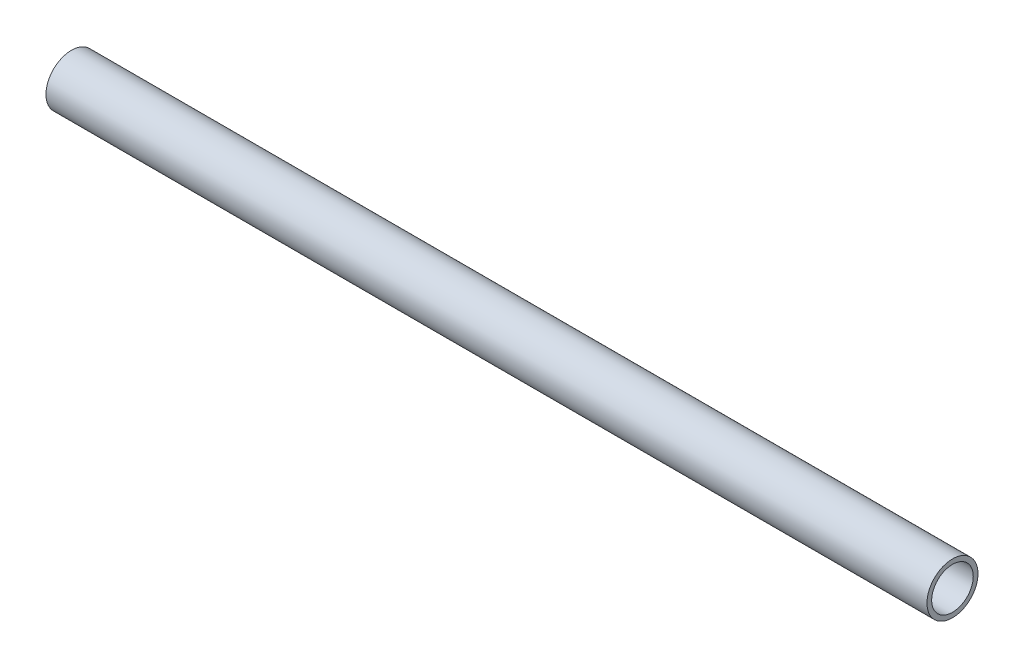
ISO-10303-21;
HEADER;
FILE_DESCRIPTION(('STEP AP214'),'2;1');
FILE_NAME('part.step','',(''),(''),'','','');
FILE_SCHEMA(('AUTOMOTIVE_DESIGN { 1 0 10303 214 1 1 1 1 }'));
ENDSEC;
DATA;
#1=APPLICATION_CONTEXT('core data for automotive mechanical design processes');
#2=APPLICATION_PROTOCOL_DEFINITION('international standard','automotive_design',2000,#1);
#3=PRODUCT_CONTEXT('',#1,'mechanical');
#4=PRODUCT('Part','Part','',(#3));
#5=PRODUCT_RELATED_PRODUCT_CATEGORY('part','',(#4));
#6=PRODUCT_DEFINITION_FORMATION('','',#4);
#7=PRODUCT_DEFINITION_CONTEXT('part definition',#1,'design');
#8=PRODUCT_DEFINITION('design','',#6,#7);
#9=PRODUCT_DEFINITION_SHAPE('','',#8);
#10=(LENGTH_UNIT() NAMED_UNIT(*) SI_UNIT(.MILLI.,.METRE.));
#11=(NAMED_UNIT(*) PLANE_ANGLE_UNIT() SI_UNIT($,.RADIAN.));
#12=(NAMED_UNIT(*) SI_UNIT($,.STERADIAN.) SOLID_ANGLE_UNIT());
#13=UNCERTAINTY_MEASURE_WITH_UNIT(LENGTH_MEASURE(1.E-05),#10,'distance_accuracy_value','');
#14=(GEOMETRIC_REPRESENTATION_CONTEXT(3) GLOBAL_UNCERTAINTY_ASSIGNED_CONTEXT((#13)) GLOBAL_UNIT_ASSIGNED_CONTEXT((#10,
#11,#12)) REPRESENTATION_CONTEXT('',''));
#15=CARTESIAN_POINT('',(0.,0.,0.));
#16=DIRECTION('',(0.,0.,1.));
#17=DIRECTION('',(1.,0.,0.));
#18=AXIS2_PLACEMENT_3D('',#15,#16,#17);
#19=CARTESIAN_POINT('',(273.9898,0.,0.));
#20=DIRECTION('',(-1.,0.,0.));
#21=DIRECTION('',(0.,0.,1.));
#22=AXIS2_PLACEMENT_3D('',#19,#20,#21);
#23=CYLINDRICAL_SURFACE('',#22,6.4643);
#24=CARTESIAN_POINT('',(273.9898,0.,0.));
#25=DIRECTION('',(1.,0.,0.));
#26=DIRECTION('',(0.,0.,-1.));
#27=AXIS2_PLACEMENT_3D('',#24,#25,#26);
#28=CIRCLE('',#27,6.4643);
#29=CARTESIAN_POINT('',(273.9898,0.,-6.4643));
#30=VERTEX_POINT('',#29);
#31=EDGE_CURVE('E45',#30,#30,#28,.T.);
#32=ORIENTED_EDGE('',*,*,#31,.T.);
#33=EDGE_LOOP('',(#32));
#34=FACE_BOUND('',#33,.T.);
#35=CARTESIAN_POINT('',(0.,0.,0.));
#36=DIRECTION('',(1.,0.,0.));
#37=DIRECTION('',(0.,0.,-1.));
#38=AXIS2_PLACEMENT_3D('',#35,#36,#37);
#39=CIRCLE('',#38,6.4643);
#40=CARTESIAN_POINT('',(0.,0.,-6.4643));
#41=VERTEX_POINT('',#40);
#42=EDGE_CURVE('E51',#41,#41,#39,.T.);
#43=ORIENTED_EDGE('',*,*,#42,.F.);
#44=EDGE_LOOP('',(#43));
#45=FACE_BOUND('',#44,.T.);
#46=ADVANCED_FACE('F38',(#34,#45),#23,.F.);
#47=CARTESIAN_POINT('',(273.9898,0.,0.));
#48=DIRECTION('',(-1.,0.,0.));
#49=DIRECTION('',(0.,0.,1.));
#50=AXIS2_PLACEMENT_3D('',#47,#48,#49);
#51=CYLINDRICAL_SURFACE('',#50,7.9375);
#52=CARTESIAN_POINT('',(273.9898,0.,0.));
#53=DIRECTION('',(1.,0.,0.));
#54=DIRECTION('',(0.,0.,-1.));
#55=AXIS2_PLACEMENT_3D('',#52,#53,#54);
#56=CIRCLE('',#55,7.9375);
#57=CARTESIAN_POINT('',(273.9898,0.,-7.9375));
#58=VERTEX_POINT('',#57);
#59=EDGE_CURVE('E11',#58,#58,#56,.T.);
#60=ORIENTED_EDGE('',*,*,#59,.F.);
#61=EDGE_LOOP('',(#60));
#62=FACE_BOUND('',#61,.T.);
#63=CARTESIAN_POINT('',(0.,0.,0.));
#64=DIRECTION('',(1.,0.,0.));
#65=DIRECTION('',(0.,0.,-1.));
#66=AXIS2_PLACEMENT_3D('',#63,#64,#65);
#67=CIRCLE('',#66,7.9375);
#68=CARTESIAN_POINT('',(0.,0.,-7.9375));
#69=VERTEX_POINT('',#68);
#70=EDGE_CURVE('E41',#69,#69,#67,.T.);
#71=ORIENTED_EDGE('',*,*,#70,.T.);
#72=EDGE_LOOP('',(#71));
#73=FACE_BOUND('',#72,.T.);
#74=ADVANCED_FACE('F58',(#62,#73),#51,.T.);
#75=CARTESIAN_POINT('',(273.9898,0.,0.));
#76=DIRECTION('',(1.,0.,0.));
#77=DIRECTION('',(0.,0.,-1.));
#78=AXIS2_PLACEMENT_3D('',#75,#76,#77);
#79=PLANE('',#78);
#80=ORIENTED_EDGE('',*,*,#31,.F.);
#81=EDGE_LOOP('',(#80));
#82=FACE_BOUND('',#81,.T.);
#83=ORIENTED_EDGE('',*,*,#59,.T.);
#84=EDGE_LOOP('',(#83));
#85=FACE_BOUND('',#84,.T.);
#86=ADVANCED_FACE('F62',(#82,#85),#79,.T.);
#87=CARTESIAN_POINT('',(0.,0.,0.));
#88=DIRECTION('',(1.,0.,0.));
#89=DIRECTION('',(0.,0.,-1.));
#90=AXIS2_PLACEMENT_3D('',#87,#88,#89);
#91=PLANE('',#90);
#92=ORIENTED_EDGE('',*,*,#42,.T.);
#93=EDGE_LOOP('',(#92));
#94=FACE_BOUND('',#93,.T.);
#95=ORIENTED_EDGE('',*,*,#70,.F.);
#96=EDGE_LOOP('',(#95));
#97=FACE_BOUND('',#96,.T.);
#98=ADVANCED_FACE('F60',(#94,#97),#91,.F.);
#99=CLOSED_SHELL('',(#46,#74,#86,#98));
#100=MANIFOLD_SOLID_BREP('B2',#99);
#101=ADVANCED_BREP_SHAPE_REPRESENTATION('',(#18,#100),#14);
#102=SHAPE_DEFINITION_REPRESENTATION(#9,#101);
ENDSEC;
END-ISO-10303-21;
